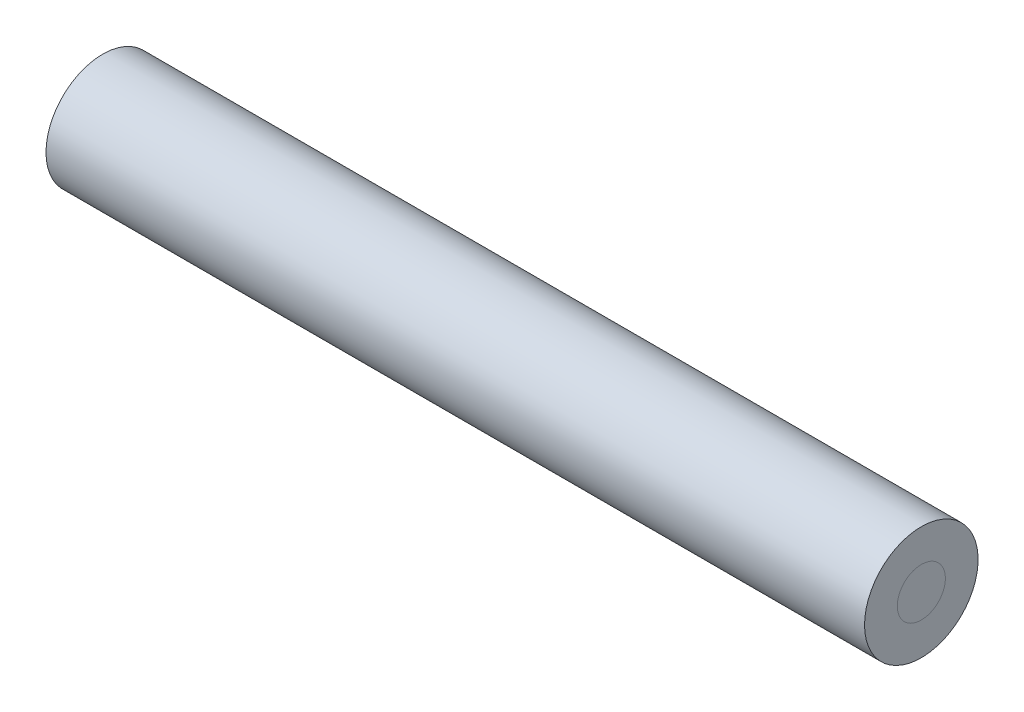
ISO-10303-21;
HEADER;
FILE_DESCRIPTION(('STEP AP214'),'2;1');
FILE_NAME('part.step','',(''),(''),'','','');
FILE_SCHEMA(('AUTOMOTIVE_DESIGN { 1 0 10303 214 1 1 1 1 }'));
ENDSEC;
DATA;
#1=APPLICATION_CONTEXT('core data for automotive mechanical design processes');
#2=APPLICATION_PROTOCOL_DEFINITION('international standard','automotive_design',2000,#1);
#3=PRODUCT_CONTEXT('',#1,'mechanical');
#4=PRODUCT('Part','Part','',(#3));
#5=PRODUCT_RELATED_PRODUCT_CATEGORY('part','',(#4));
#6=PRODUCT_DEFINITION_FORMATION('','',#4);
#7=PRODUCT_DEFINITION_CONTEXT('part definition',#1,'design');
#8=PRODUCT_DEFINITION('design','',#6,#7);
#9=PRODUCT_DEFINITION_SHAPE('','',#8);
#10=(LENGTH_UNIT() NAMED_UNIT(*) SI_UNIT(.MILLI.,.METRE.));
#11=(NAMED_UNIT(*) PLANE_ANGLE_UNIT() SI_UNIT($,.RADIAN.));
#12=(NAMED_UNIT(*) SI_UNIT($,.STERADIAN.) SOLID_ANGLE_UNIT());
#13=UNCERTAINTY_MEASURE_WITH_UNIT(LENGTH_MEASURE(1.E-05),#10,'distance_accuracy_value','');
#14=(GEOMETRIC_REPRESENTATION_CONTEXT(3) GLOBAL_UNCERTAINTY_ASSIGNED_CONTEXT((#13)) GLOBAL_UNIT_ASSIGNED_CONTEXT((#10,
#11,#12)) REPRESENTATION_CONTEXT('',''));
#15=CARTESIAN_POINT('',(0.,0.,0.));
#16=DIRECTION('',(0.,0.,1.));
#17=DIRECTION('',(1.,0.,0.));
#18=AXIS2_PLACEMENT_3D('',#15,#16,#17);
#19=CARTESIAN_POINT('',(-23.634620275434,50.6057565368192,-16.7706387357889));
#20=DIRECTION('',(1.,0.,0.));
#21=DIRECTION('',(0.,0.,-1.));
#22=AXIS2_PLACEMENT_3D('',#19,#20,#21);
#23=CYLINDRICAL_SURFACE('',#22,0.596900000000002);
#24=CARTESIAN_POINT('',(-23.634620275434,50.6057565368192,-16.7706387357889));
#25=DIRECTION('',(-1.,0.,0.));
#26=DIRECTION('',(0.,0.,1.));
#27=AXIS2_PLACEMENT_3D('',#24,#25,#26);
#28=CIRCLE('',#27,0.596900000000002);
#29=CARTESIAN_POINT('',(-23.634620275434,50.6057565368192,-16.1737387357889));
#30=VERTEX_POINT('',#29);
#31=EDGE_CURVE('E63',#30,#30,#28,.T.);
#32=ORIENTED_EDGE('',*,*,#31,.T.);
#33=EDGE_LOOP('',(#32));
#34=FACE_BOUND('',#33,.T.);
#35=CARTESIAN_POINT('',(-3.31462027543401,50.6057565368192,-16.7706387357888));
#36=DIRECTION('',(-1.,0.,0.));
#37=DIRECTION('',(0.,0.,1.));
#38=AXIS2_PLACEMENT_3D('',#35,#36,#37);
#39=CIRCLE('',#38,0.596900000000002);
#40=CARTESIAN_POINT('',(-3.31462027543401,50.6057565368192,-16.1737387357888));
#41=VERTEX_POINT('',#40);
#42=EDGE_CURVE('E71',#41,#41,#39,.T.);
#43=ORIENTED_EDGE('',*,*,#42,.F.);
#44=EDGE_LOOP('',(#43));
#45=FACE_BOUND('',#44,.T.);
#46=ADVANCED_FACE('F55',(#34,#45),#23,.F.);
#47=CARTESIAN_POINT('',(-23.634620275434,50.6057565368192,-16.7706387357889));
#48=DIRECTION('',(1.,0.,0.));
#49=DIRECTION('',(0.,0.,-1.));
#50=AXIS2_PLACEMENT_3D('',#47,#48,#49);
#51=CYLINDRICAL_SURFACE('',#50,1.4097);
#52=CARTESIAN_POINT('',(-23.634620275434,50.6057565368192,-16.7706387357889));
#53=DIRECTION('',(-1.,0.,0.));
#54=DIRECTION('',(0.,0.,1.));
#55=AXIS2_PLACEMENT_3D('',#52,#53,#54);
#56=CIRCLE('',#55,1.4097);
#57=CARTESIAN_POINT('',(-23.634620275434,50.6057565368192,-15.3609387357889));
#58=VERTEX_POINT('',#57);
#59=EDGE_CURVE('E11',#58,#58,#56,.T.);
#60=ORIENTED_EDGE('',*,*,#59,.F.);
#61=EDGE_LOOP('',(#60));
#62=FACE_BOUND('',#61,.T.);
#63=CARTESIAN_POINT('',(-3.31462027543401,50.6057565368192,-16.7706387357888));
#64=DIRECTION('',(-1.,0.,0.));
#65=DIRECTION('',(0.,0.,1.));
#66=AXIS2_PLACEMENT_3D('',#63,#64,#65);
#67=CIRCLE('',#66,1.4097);
#68=CARTESIAN_POINT('',(-3.31462027543401,50.6057565368192,-15.3609387357888));
#69=VERTEX_POINT('',#68);
#70=EDGE_CURVE('E58',#69,#69,#67,.T.);
#71=ORIENTED_EDGE('',*,*,#70,.T.);
#72=EDGE_LOOP('',(#71));
#73=FACE_BOUND('',#72,.T.);
#74=ADVANCED_FACE('F79',(#62,#73),#51,.T.);
#75=CARTESIAN_POINT('',(-23.634620275434,0.,0.));
#76=DIRECTION('',(-1.,0.,0.));
#77=DIRECTION('',(0.,0.,1.));
#78=AXIS2_PLACEMENT_3D('',#75,#76,#77);
#79=PLANE('',#78);
#80=ORIENTED_EDGE('',*,*,#31,.F.);
#81=EDGE_LOOP('',(#80));
#82=FACE_BOUND('',#81,.T.);
#83=ORIENTED_EDGE('',*,*,#59,.T.);
#84=EDGE_LOOP('',(#83));
#85=FACE_BOUND('',#84,.T.);
#86=ADVANCED_FACE('F83',(#82,#85),#79,.T.);
#87=CARTESIAN_POINT('',(-3.31462027543397,0.,0.));
#88=DIRECTION('',(-1.,0.,0.));
#89=DIRECTION('',(0.,0.,1.));
#90=AXIS2_PLACEMENT_3D('',#87,#88,#89);
#91=PLANE('',#90);
#92=ORIENTED_EDGE('',*,*,#42,.T.);
#93=EDGE_LOOP('',(#92));
#94=FACE_BOUND('',#93,.T.);
#95=ORIENTED_EDGE('',*,*,#70,.F.);
#96=EDGE_LOOP('',(#95));
#97=FACE_BOUND('',#96,.T.);
#98=ADVANCED_FACE('F81',(#94,#97),#91,.F.);
#99=CLOSED_SHELL('',(#46,#74,#86,#98));
#100=MANIFOLD_SOLID_BREP('B2',#99);
#101=CARTESIAN_POINT('',(-23.634620275434,50.6057565368192,-16.7706387357889));
#102=DIRECTION('',(1.,0.,0.));
#103=DIRECTION('',(0.,0.,-1.));
#104=AXIS2_PLACEMENT_3D('',#101,#102,#103);
#105=CYLINDRICAL_SURFACE('',#104,0.596900000000002);
#106=CARTESIAN_POINT('',(-23.634620275434,50.6057565368192,-16.7706387357889));
#107=DIRECTION('',(-1.,0.,0.));
#108=DIRECTION('',(0.,0.,1.));
#109=AXIS2_PLACEMENT_3D('',#106,#107,#108);
#110=CIRCLE('',#109,0.596900000000002);
#111=CARTESIAN_POINT('',(-23.634620275434,50.6057565368192,-16.1737387357889));
#112=VERTEX_POINT('',#111);
#113=EDGE_CURVE('E54',#112,#112,#110,.T.);
#114=ORIENTED_EDGE('',*,*,#113,.F.);
#115=EDGE_LOOP('',(#114));
#116=FACE_BOUND('',#115,.T.);
#117=CARTESIAN_POINT('',(-3.31462027543401,50.6057565368192,-16.7706387357888));
#118=DIRECTION('',(-1.,0.,0.));
#119=DIRECTION('',(0.,0.,1.));
#120=AXIS2_PLACEMENT_3D('',#117,#118,#119);
#121=CIRCLE('',#120,0.596900000000002);
#122=CARTESIAN_POINT('',(-3.31462027543401,50.6057565368192,-16.1737387357888));
#123=VERTEX_POINT('',#122);
#124=EDGE_CURVE('E143',#123,#123,#121,.T.);
#125=ORIENTED_EDGE('',*,*,#124,.T.);
#126=EDGE_LOOP('',(#125));
#127=FACE_BOUND('',#126,.T.);
#128=ADVANCED_FACE('F140',(#116,#127),#105,.T.);
#129=CARTESIAN_POINT('',(-23.634620275434,0.,0.));
#130=DIRECTION('',(-1.,0.,0.));
#131=DIRECTION('',(0.,0.,1.));
#132=AXIS2_PLACEMENT_3D('',#129,#130,#131);
#133=PLANE('',#132);
#134=ORIENTED_EDGE('',*,*,#113,.T.);
#135=EDGE_LOOP('',(#134));
#136=FACE_BOUND('',#135,.T.);
#137=ADVANCED_FACE('F157',(#136),#133,.T.);
#138=CARTESIAN_POINT('',(-3.31462027543397,0.,0.));
#139=DIRECTION('',(-1.,0.,0.));
#140=DIRECTION('',(0.,0.,1.));
#141=AXIS2_PLACEMENT_3D('',#138,#139,#140);
#142=PLANE('',#141);
#143=ORIENTED_EDGE('',*,*,#124,.F.);
#144=EDGE_LOOP('',(#143));
#145=FACE_BOUND('',#144,.T.);
#146=ADVANCED_FACE('F155',(#145),#142,.F.);
#147=CLOSED_SHELL('',(#128,#137,#146));
#148=MANIFOLD_SOLID_BREP('B6',#147);
#149=ADVANCED_BREP_SHAPE_REPRESENTATION('',(#18,#100,#148),#14);
#150=SHAPE_DEFINITION_REPRESENTATION(#9,#149);
ENDSEC;
END-ISO-10303-21;
